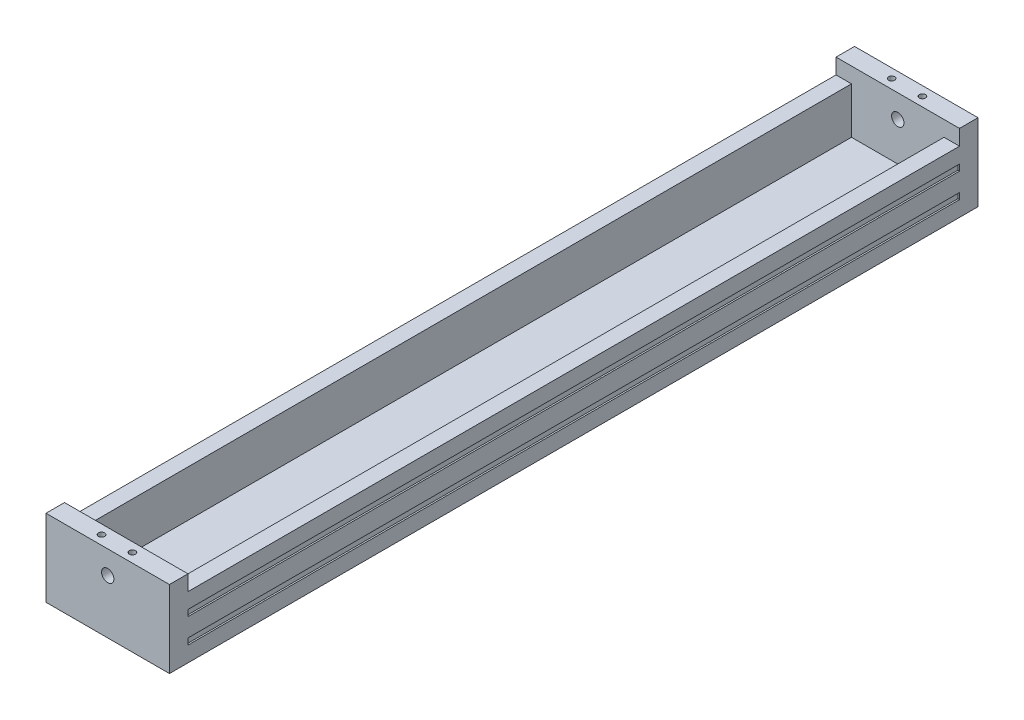
ISO-10303-21;
HEADER;
FILE_DESCRIPTION(('STEP AP214'),'2;1');
FILE_NAME('part.step','',(''),(''),'','','');
FILE_SCHEMA(('AUTOMOTIVE_DESIGN { 1 0 10303 214 1 1 1 1 }'));
ENDSEC;
DATA;
#1=APPLICATION_CONTEXT('core data for automotive mechanical design processes');
#2=APPLICATION_PROTOCOL_DEFINITION('international standard','automotive_design',2000,#1);
#3=PRODUCT_CONTEXT('',#1,'mechanical');
#4=PRODUCT('Part','Part','',(#3));
#5=PRODUCT_RELATED_PRODUCT_CATEGORY('part','',(#4));
#6=PRODUCT_DEFINITION_FORMATION('','',#4);
#7=PRODUCT_DEFINITION_CONTEXT('part definition',#1,'design');
#8=PRODUCT_DEFINITION('design','',#6,#7);
#9=PRODUCT_DEFINITION_SHAPE('','',#8);
#10=(LENGTH_UNIT() NAMED_UNIT(*) SI_UNIT(.MILLI.,.METRE.));
#11=(NAMED_UNIT(*) PLANE_ANGLE_UNIT() SI_UNIT($,.RADIAN.));
#12=(NAMED_UNIT(*) SI_UNIT($,.STERADIAN.) SOLID_ANGLE_UNIT());
#13=UNCERTAINTY_MEASURE_WITH_UNIT(LENGTH_MEASURE(1.E-05),#10,'distance_accuracy_value','');
#14=(GEOMETRIC_REPRESENTATION_CONTEXT(3) GLOBAL_UNCERTAINTY_ASSIGNED_CONTEXT((#13)) GLOBAL_UNIT_ASSIGNED_CONTEXT((#10,
#11,#12)) REPRESENTATION_CONTEXT('',''));
#15=CARTESIAN_POINT('',(0.,0.,0.));
#16=DIRECTION('',(0.,0.,1.));
#17=DIRECTION('',(1.,0.,0.));
#18=AXIS2_PLACEMENT_3D('',#15,#16,#17);
#19=CARTESIAN_POINT('',(-40.,25.,12.));
#20=DIRECTION('',(1.,0.,0.));
#21=DIRECTION('',(0.,1.,0.));
#22=AXIS2_PLACEMENT_3D('',#19,#20,#21);
#23=PLANE('',#22);
#24=DIRECTION('',(0.,0.,-1.));
#25=VECTOR('',#24,1.);
#26=CARTESIAN_POINT('',(-40.,-15.,0.));
#27=LINE('',#26,#25);
#28=CARTESIAN_POINT('',(-40.,-15.,0.));
#29=VERTEX_POINT('',#28);
#30=CARTESIAN_POINT('',(-40.,-15.,-500.));
#31=VERTEX_POINT('',#30);
#32=EDGE_CURVE('E352',#29,#31,#27,.T.);
#33=ORIENTED_EDGE('',*,*,#32,.T.);
#34=DIRECTION('',(0.,-1.,0.));
#35=VECTOR('',#34,1.);
#36=CARTESIAN_POINT('',(-40.,25.,-500.));
#37=LINE('',#36,#35);
#38=CARTESIAN_POINT('',(-40.,-11.,-500.));
#39=VERTEX_POINT('',#38);
#40=EDGE_CURVE('E252',#39,#31,#37,.T.);
#41=ORIENTED_EDGE('',*,*,#40,.F.);
#42=DIRECTION('',(0.,0.,-1.));
#43=VECTOR('',#42,1.);
#44=CARTESIAN_POINT('',(-40.,-11.,0.));
#45=LINE('',#44,#43);
#46=CARTESIAN_POINT('',(-40.,-11.,0.));
#47=VERTEX_POINT('',#46);
#48=EDGE_CURVE('E364',#47,#39,#45,.T.);
#49=ORIENTED_EDGE('',*,*,#48,.F.);
#50=DIRECTION('',(0.,1.,0.));
#51=VECTOR('',#50,1.);
#52=CARTESIAN_POINT('',(-40.,0.,0.));
#53=LINE('',#52,#51);
#54=EDGE_CURVE('E282',#29,#47,#53,.T.);
#55=ORIENTED_EDGE('',*,*,#54,.F.);
#56=EDGE_LOOP('',(#33,#41,#49,#55));
#57=FACE_BOUND('',#56,.T.);
#58=DIRECTION('',(0.,0.,-1.));
#59=VECTOR('',#58,1.);
#60=CARTESIAN_POINT('',(-40.,1.,0.));
#61=LINE('',#60,#59);
#62=CARTESIAN_POINT('',(-40.,1.,0.));
#63=VERTEX_POINT('',#62);
#64=CARTESIAN_POINT('',(-40.,0.999999999999938,-500.));
#65=VERTEX_POINT('',#64);
#66=EDGE_CURVE('E319',#63,#65,#61,.T.);
#67=ORIENTED_EDGE('',*,*,#66,.T.);
#68=CARTESIAN_POINT('',(-40.,4.99999999999997,-500.));
#69=VERTEX_POINT('',#68);
#70=EDGE_CURVE('E251',#69,#65,#37,.T.);
#71=ORIENTED_EDGE('',*,*,#70,.F.);
#72=DIRECTION('',(0.,0.,-1.));
#73=VECTOR('',#72,1.);
#74=CARTESIAN_POINT('',(-40.,5.,0.));
#75=LINE('',#74,#73);
#76=CARTESIAN_POINT('',(-40.,5.,0.));
#77=VERTEX_POINT('',#76);
#78=EDGE_CURVE('E332',#77,#69,#75,.T.);
#79=ORIENTED_EDGE('',*,*,#78,.F.);
#80=DIRECTION('',(0.,-1.,0.));
#81=VECTOR('',#80,1.);
#82=CARTESIAN_POINT('',(-40.,0.,0.));
#83=LINE('',#82,#81);
#84=EDGE_CURVE('E329',#77,#63,#83,.T.);
#85=ORIENTED_EDGE('',*,*,#84,.T.);
#86=EDGE_LOOP('',(#67,#71,#79,#85));
#87=FACE_BOUND('',#86,.T.);
#88=DIRECTION('',(0.,-1.,0.));
#89=VECTOR('',#88,1.);
#90=CARTESIAN_POINT('',(-40.,25.,-512.));
#91=LINE('',#90,#89);
#92=CARTESIAN_POINT('',(-40.,25.,-512.));
#93=VERTEX_POINT('',#92);
#94=CARTESIAN_POINT('',(-40.,-25.,-512.));
#95=VERTEX_POINT('',#94);
#96=EDGE_CURVE('E221',#93,#95,#91,.T.);
#97=ORIENTED_EDGE('',*,*,#96,.T.);
#98=DIRECTION('',(0.,0.,-1.));
#99=VECTOR('',#98,1.);
#100=CARTESIAN_POINT('',(-40.,-25.,12.));
#101=LINE('',#100,#99);
#102=CARTESIAN_POINT('',(-40.,-25.,12.));
#103=VERTEX_POINT('',#102);
#104=EDGE_CURVE('E11',#103,#95,#101,.T.);
#105=ORIENTED_EDGE('',*,*,#104,.F.);
#106=DIRECTION('',(0.,-1.,0.));
#107=VECTOR('',#106,1.);
#108=CARTESIAN_POINT('',(-40.,25.,12.));
#109=LINE('',#108,#107);
#110=CARTESIAN_POINT('',(-40.,25.,12.));
#111=VERTEX_POINT('',#110);
#112=EDGE_CURVE('E428',#111,#103,#109,.T.);
#113=ORIENTED_EDGE('',*,*,#112,.F.);
#114=DIRECTION('',(0.,0.,-1.));
#115=VECTOR('',#114,1.);
#116=CARTESIAN_POINT('',(-40.,25.,12.));
#117=LINE('',#116,#115);
#118=CARTESIAN_POINT('',(-40.,25.,0.));
#119=VERTEX_POINT('',#118);
#120=EDGE_CURVE('E438',#111,#119,#117,.T.);
#121=ORIENTED_EDGE('',*,*,#120,.T.);
#122=DIRECTION('',(0.,-1.,0.));
#123=VECTOR('',#122,1.);
#124=CARTESIAN_POINT('',(-40.,25.,0.));
#125=LINE('',#124,#123);
#126=CARTESIAN_POINT('',(-40.,15.,0.));
#127=VERTEX_POINT('',#126);
#128=EDGE_CURVE('E419',#119,#127,#125,.T.);
#129=ORIENTED_EDGE('',*,*,#128,.T.);
#130=DIRECTION('',(0.,0.,1.));
#131=VECTOR('',#130,1.);
#132=CARTESIAN_POINT('',(-40.,15.,-500.));
#133=LINE('',#132,#131);
#134=CARTESIAN_POINT('',(-40.,15.,-500.));
#135=VERTEX_POINT('',#134);
#136=EDGE_CURVE('E412',#135,#127,#133,.T.);
#137=ORIENTED_EDGE('',*,*,#136,.F.);
#138=CARTESIAN_POINT('',(-40.,25.,-500.));
#139=VERTEX_POINT('',#138);
#140=EDGE_CURVE('E224',#139,#135,#37,.T.);
#141=ORIENTED_EDGE('',*,*,#140,.F.);
#142=DIRECTION('',(0.,0.,1.));
#143=VECTOR('',#142,1.);
#144=CARTESIAN_POINT('',(-40.,25.,-512.));
#145=LINE('',#144,#143);
#146=EDGE_CURVE('E218',#93,#139,#145,.T.);
#147=ORIENTED_EDGE('',*,*,#146,.F.);
#148=EDGE_LOOP('',(#97,#105,#113,#121,#129,#137,#141,#147));
#149=FACE_BOUND('',#148,.T.);
#150=ADVANCED_FACE('F35',(#57,#87,#149),#23,.F.);
#151=CARTESIAN_POINT('',(40.,15.,-500.));
#152=DIRECTION('',(0.,-1.,0.));
#153=DIRECTION('',(0.,0.,-1.));
#154=AXIS2_PLACEMENT_3D('',#151,#152,#153);
#155=PLANE('',#154);
#156=DIRECTION('',(1.,0.,0.));
#157=VECTOR('',#156,1.);
#158=CARTESIAN_POINT('',(40.,15.,0.));
#159=LINE('',#158,#157);
#160=CARTESIAN_POINT('',(-29.9999999999999,15.,0.));
#161=VERTEX_POINT('',#160);
#162=EDGE_CURVE('E407',#127,#161,#159,.T.);
#163=ORIENTED_EDGE('',*,*,#162,.T.);
#164=DIRECTION('',(0.,0.,1.));
#165=VECTOR('',#164,1.);
#166=CARTESIAN_POINT('',(-30.,15.,-500.));
#167=LINE('',#166,#165);
#168=CARTESIAN_POINT('',(-30.,15.,-500.));
#169=VERTEX_POINT('',#168);
#170=EDGE_CURVE('E341',#169,#161,#167,.T.);
#171=ORIENTED_EDGE('',*,*,#170,.F.);
#172=DIRECTION('',(1.,0.,0.));
#173=VECTOR('',#172,1.);
#174=CARTESIAN_POINT('',(40.,15.,-500.));
#175=LINE('',#174,#173);
#176=EDGE_CURVE('E403',#135,#169,#175,.T.);
#177=ORIENTED_EDGE('',*,*,#176,.F.);
#178=ORIENTED_EDGE('',*,*,#136,.T.);
#179=EDGE_LOOP('',(#163,#171,#177,#178));
#180=FACE_BOUND('',#179,.T.);
#181=ADVANCED_FACE('F471',(#180),#155,.F.);
#182=CARTESIAN_POINT('',(0.,0.,0.));
#183=DIRECTION('',(0.,0.,1.));
#184=DIRECTION('',(1.,0.,0.));
#185=AXIS2_PLACEMENT_3D('',#182,#183,#184);
#186=PLANE('',#185);
#187=CARTESIAN_POINT('',(0.,10.,0.));
#188=DIRECTION('',(0.,0.,1.));
#189=DIRECTION('',(1.,0.,0.));
#190=AXIS2_PLACEMENT_3D('',#187,#188,#189);
#191=CIRCLE('',#190,4.);
#192=CARTESIAN_POINT('',(4.,10.,0.));
#193=VERTEX_POINT('',#192);
#194=EDGE_CURVE('E539',#193,#193,#191,.T.);
#195=ORIENTED_EDGE('',*,*,#194,.T.);
#196=EDGE_LOOP('',(#195));
#197=FACE_BOUND('',#196,.T.);
#198=ORIENTED_EDGE('',*,*,#162,.F.);
#199=ORIENTED_EDGE('',*,*,#128,.F.);
#200=DIRECTION('',(-1.,0.,0.));
#201=VECTOR('',#200,1.);
#202=CARTESIAN_POINT('',(-40.,25.,0.));
#203=LINE('',#202,#201);
#204=CARTESIAN_POINT('',(40.,25.,0.));
#205=VERTEX_POINT('',#204);
#206=EDGE_CURVE('E432',#205,#119,#203,.T.);
#207=ORIENTED_EDGE('',*,*,#206,.F.);
#208=DIRECTION('',(0.,1.,0.));
#209=VECTOR('',#208,1.);
#210=CARTESIAN_POINT('',(40.,25.,0.));
#211=LINE('',#210,#209);
#212=CARTESIAN_POINT('',(40.,15.,0.));
#213=VERTEX_POINT('',#212);
#214=EDGE_CURVE('E441',#213,#205,#211,.T.);
#215=ORIENTED_EDGE('',*,*,#214,.F.);
#216=CARTESIAN_POINT('',(30.0000000000001,15.,0.));
#217=VERTEX_POINT('',#216);
#218=EDGE_CURVE('E397',#217,#213,#159,.T.);
#219=ORIENTED_EDGE('',*,*,#218,.F.);
#220=DIRECTION('',(0.,1.,0.));
#221=VECTOR('',#220,1.);
#222=CARTESIAN_POINT('',(30.0000000000001,-14.9999999999999,0.));
#223=LINE('',#222,#221);
#224=CARTESIAN_POINT('',(30.0000000000001,-14.9999999999999,0.));
#225=VERTEX_POINT('',#224);
#226=EDGE_CURVE('E400',#225,#217,#223,.T.);
#227=ORIENTED_EDGE('',*,*,#226,.F.);
#228=DIRECTION('',(1.,0.,0.));
#229=VECTOR('',#228,1.);
#230=CARTESIAN_POINT('',(-29.9999999999999,-14.9999999999999,0.));
#231=LINE('',#230,#229);
#232=CARTESIAN_POINT('',(-29.9999999999999,-14.9999999999999,0.));
#233=VERTEX_POINT('',#232);
#234=EDGE_CURVE('E379',#233,#225,#231,.T.);
#235=ORIENTED_EDGE('',*,*,#234,.F.);
#236=DIRECTION('',(0.,1.,0.));
#237=VECTOR('',#236,1.);
#238=CARTESIAN_POINT('',(-29.9999999999999,-14.9999999999999,0.));
#239=LINE('',#238,#237);
#240=EDGE_CURVE('E389',#233,#161,#239,.T.);
#241=ORIENTED_EDGE('',*,*,#240,.T.);
#242=EDGE_LOOP('',(#198,#199,#207,#215,#219,#227,#235,#241));
#243=FACE_BOUND('',#242,.T.);
#244=ADVANCED_FACE('F467',(#197,#243),#186,.F.);
#245=CARTESIAN_POINT('',(-40.,-25.,12.));
#246=DIRECTION('',(0.,1.,0.));
#247=DIRECTION('',(0.,0.,1.));
#248=AXIS2_PLACEMENT_3D('',#245,#246,#247);
#249=PLANE('',#248);
#250=ORIENTED_EDGE('',*,*,#104,.T.);
#251=DIRECTION('',(1.,0.,0.));
#252=VECTOR('',#251,1.);
#253=CARTESIAN_POINT('',(-40.,-25.,-512.));
#254=LINE('',#253,#252);
#255=CARTESIAN_POINT('',(40.,-25.,-512.));
#256=VERTEX_POINT('',#255);
#257=EDGE_CURVE('E238',#95,#256,#254,.T.);
#258=ORIENTED_EDGE('',*,*,#257,.T.);
#259=DIRECTION('',(0.,0.,-1.));
#260=VECTOR('',#259,1.);
#261=CARTESIAN_POINT('',(40.,-25.,12.));
#262=LINE('',#261,#260);
#263=CARTESIAN_POINT('',(40.,-25.,12.));
#264=VERTEX_POINT('',#263);
#265=EDGE_CURVE('E42',#264,#256,#262,.T.);
#266=ORIENTED_EDGE('',*,*,#265,.F.);
#267=DIRECTION('',(1.,0.,0.));
#268=VECTOR('',#267,1.);
#269=CARTESIAN_POINT('',(-40.,-25.,12.));
#270=LINE('',#269,#268);
#271=EDGE_CURVE('E431',#103,#264,#270,.T.);
#272=ORIENTED_EDGE('',*,*,#271,.F.);
#273=EDGE_LOOP('',(#250,#258,#266,#272));
#274=FACE_BOUND('',#273,.T.);
#275=ADVANCED_FACE('F455',(#274),#249,.F.);
#276=CARTESIAN_POINT('',(40.,25.,12.));
#277=DIRECTION('',(-1.,0.,0.));
#278=DIRECTION('',(0.,-1.,0.));
#279=AXIS2_PLACEMENT_3D('',#276,#277,#278);
#280=PLANE('',#279);
#281=DIRECTION('',(0.,0.,1.));
#282=VECTOR('',#281,1.);
#283=CARTESIAN_POINT('',(40.,-11.,0.));
#284=LINE('',#283,#282);
#285=CARTESIAN_POINT('',(40.,-11.,-500.));
#286=VERTEX_POINT('',#285);
#287=CARTESIAN_POINT('',(40.,-11.,0.));
#288=VERTEX_POINT('',#287);
#289=EDGE_CURVE('E292',#286,#288,#284,.T.);
#290=ORIENTED_EDGE('',*,*,#289,.F.);
#291=DIRECTION('',(0.,1.,0.));
#292=VECTOR('',#291,1.);
#293=CARTESIAN_POINT('',(40.,25.,-500.));
#294=LINE('',#293,#292);
#295=CARTESIAN_POINT('',(40.,-15.,-500.));
#296=VERTEX_POINT('',#295);
#297=EDGE_CURVE('E239',#296,#286,#294,.T.);
#298=ORIENTED_EDGE('',*,*,#297,.F.);
#299=DIRECTION('',(0.,0.,-1.));
#300=VECTOR('',#299,1.);
#301=CARTESIAN_POINT('',(40.,-15.,0.));
#302=LINE('',#301,#300);
#303=CARTESIAN_POINT('',(40.,-15.,0.));
#304=VERTEX_POINT('',#303);
#305=EDGE_CURVE('E303',#304,#296,#302,.T.);
#306=ORIENTED_EDGE('',*,*,#305,.F.);
#307=DIRECTION('',(0.,-1.,0.));
#308=VECTOR('',#307,1.);
#309=CARTESIAN_POINT('',(40.,-11.,0.));
#310=LINE('',#309,#308);
#311=EDGE_CURVE('E49',#288,#304,#310,.T.);
#312=ORIENTED_EDGE('',*,*,#311,.F.);
#313=EDGE_LOOP('',(#290,#298,#306,#312));
#314=FACE_BOUND('',#313,.T.);
#315=ORIENTED_EDGE('',*,*,#265,.T.);
#316=DIRECTION('',(0.,1.,0.));
#317=VECTOR('',#316,1.);
#318=CARTESIAN_POINT('',(40.,25.,-512.));
#319=LINE('',#318,#317);
#320=CARTESIAN_POINT('',(40.,25.,-512.));
#321=VERTEX_POINT('',#320);
#322=EDGE_CURVE('E243',#256,#321,#319,.T.);
#323=ORIENTED_EDGE('',*,*,#322,.T.);
#324=DIRECTION('',(0.,0.,1.));
#325=VECTOR('',#324,1.);
#326=CARTESIAN_POINT('',(40.,25.,-512.));
#327=LINE('',#326,#325);
#328=CARTESIAN_POINT('',(40.,25.,-500.));
#329=VERTEX_POINT('',#328);
#330=EDGE_CURVE('E229',#321,#329,#327,.T.);
#331=ORIENTED_EDGE('',*,*,#330,.T.);
#332=CARTESIAN_POINT('',(40.,15.,-500.));
#333=VERTEX_POINT('',#332);
#334=EDGE_CURVE('E254',#333,#329,#294,.T.);
#335=ORIENTED_EDGE('',*,*,#334,.F.);
#336=DIRECTION('',(0.,0.,1.));
#337=VECTOR('',#336,1.);
#338=CARTESIAN_POINT('',(40.,15.,-500.));
#339=LINE('',#338,#337);
#340=EDGE_CURVE('E405',#333,#213,#339,.T.);
#341=ORIENTED_EDGE('',*,*,#340,.T.);
#342=ORIENTED_EDGE('',*,*,#214,.T.);
#343=DIRECTION('',(0.,0.,-1.));
#344=VECTOR('',#343,1.);
#345=CARTESIAN_POINT('',(40.,25.,12.));
#346=LINE('',#345,#344);
#347=CARTESIAN_POINT('',(40.,25.,12.));
#348=VERTEX_POINT('',#347);
#349=EDGE_CURVE('E446',#348,#205,#346,.T.);
#350=ORIENTED_EDGE('',*,*,#349,.F.);
#351=DIRECTION('',(0.,1.,0.));
#352=VECTOR('',#351,1.);
#353=CARTESIAN_POINT('',(40.,25.,12.));
#354=LINE('',#353,#352);
#355=EDGE_CURVE('E434',#264,#348,#354,.T.);
#356=ORIENTED_EDGE('',*,*,#355,.F.);
#357=EDGE_LOOP('',(#315,#323,#331,#335,#341,#342,#350,#356));
#358=FACE_BOUND('',#357,.T.);
#359=CARTESIAN_POINT('',(40.,0.999999999999997,-500.));
#360=VERTEX_POINT('',#359);
#361=CARTESIAN_POINT('',(40.,4.99999999999997,-500.));
#362=VERTEX_POINT('',#361);
#363=EDGE_CURVE('E57',#360,#362,#294,.T.);
#364=ORIENTED_EDGE('',*,*,#363,.F.);
#365=DIRECTION('',(0.,0.,-1.));
#366=VECTOR('',#365,1.);
#367=CARTESIAN_POINT('',(40.,0.999999999999999,-500.));
#368=LINE('',#367,#366);
#369=CARTESIAN_POINT('',(40.,0.999999999999938,0.));
#370=VERTEX_POINT('',#369);
#371=EDGE_CURVE('E261',#370,#360,#368,.T.);
#372=ORIENTED_EDGE('',*,*,#371,.F.);
#373=DIRECTION('',(0.,-1.,0.));
#374=VECTOR('',#373,1.);
#375=CARTESIAN_POINT('',(40.,4.99999999999994,0.));
#376=LINE('',#375,#374);
#377=CARTESIAN_POINT('',(40.,4.99999999999994,0.));
#378=VERTEX_POINT('',#377);
#379=EDGE_CURVE('E274',#378,#370,#376,.T.);
#380=ORIENTED_EDGE('',*,*,#379,.F.);
#381=DIRECTION('',(0.,0.,1.));
#382=VECTOR('',#381,1.);
#383=CARTESIAN_POINT('',(40.,5.,-500.));
#384=LINE('',#383,#382);
#385=EDGE_CURVE('E271',#362,#378,#384,.T.);
#386=ORIENTED_EDGE('',*,*,#385,.F.);
#387=EDGE_LOOP('',(#364,#372,#380,#386));
#388=FACE_BOUND('',#387,.T.);
#389=ADVANCED_FACE('F451',(#314,#358,#388),#280,.F.);
#390=CARTESIAN_POINT('',(-40.,25.,12.));
#391=DIRECTION('',(0.,-1.,0.));
#392=DIRECTION('',(0.,0.,-1.));
#393=AXIS2_PLACEMENT_3D('',#390,#391,#392);
#394=PLANE('',#393);
#395=CARTESIAN_POINT('',(-10.,25.,6.));
#396=DIRECTION('',(0.,1.,0.));
#397=DIRECTION('',(0.,0.,1.));
#398=AXIS2_PLACEMENT_3D('',#395,#396,#397);
#399=CIRCLE('',#398,2.);
#400=CARTESIAN_POINT('',(-10.,25.,8.));
#401=VERTEX_POINT('',#400);
#402=EDGE_CURVE('E420',#401,#401,#399,.T.);
#403=ORIENTED_EDGE('',*,*,#402,.F.);
#404=EDGE_LOOP('',(#403));
#405=FACE_BOUND('',#404,.T.);
#406=CARTESIAN_POINT('',(9.99999999999999,25.,6.));
#407=DIRECTION('',(0.,1.,0.));
#408=DIRECTION('',(0.,0.,1.));
#409=AXIS2_PLACEMENT_3D('',#406,#407,#408);
#410=CIRCLE('',#409,2.);
#411=CARTESIAN_POINT('',(9.99999999999999,25.,8.));
#412=VERTEX_POINT('',#411);
#413=EDGE_CURVE('E415',#412,#412,#410,.T.);
#414=ORIENTED_EDGE('',*,*,#413,.F.);
#415=EDGE_LOOP('',(#414));
#416=FACE_BOUND('',#415,.T.);
#417=ORIENTED_EDGE('',*,*,#206,.T.);
#418=ORIENTED_EDGE('',*,*,#120,.F.);
#419=DIRECTION('',(-1.,0.,0.));
#420=VECTOR('',#419,1.);
#421=CARTESIAN_POINT('',(-40.,25.,12.));
#422=LINE('',#421,#420);
#423=EDGE_CURVE('E436',#348,#111,#422,.T.);
#424=ORIENTED_EDGE('',*,*,#423,.F.);
#425=ORIENTED_EDGE('',*,*,#349,.T.);
#426=EDGE_LOOP('',(#417,#418,#424,#425));
#427=FACE_BOUND('',#426,.T.);
#428=ADVANCED_FACE('F463',(#405,#416,#427),#394,.F.);
#429=CARTESIAN_POINT('',(0.,0.,12.));
#430=DIRECTION('',(0.,0.,1.));
#431=DIRECTION('',(1.,0.,0.));
#432=AXIS2_PLACEMENT_3D('',#429,#430,#431);
#433=PLANE('',#432);
#434=CARTESIAN_POINT('',(0.,10.,12.));
#435=DIRECTION('',(0.,0.,1.));
#436=DIRECTION('',(1.,0.,0.));
#437=AXIS2_PLACEMENT_3D('',#434,#435,#436);
#438=CIRCLE('',#437,4.);
#439=CARTESIAN_POINT('',(4.,10.,12.));
#440=VERTEX_POINT('',#439);
#441=EDGE_CURVE('E548',#440,#440,#438,.T.);
#442=ORIENTED_EDGE('',*,*,#441,.F.);
#443=EDGE_LOOP('',(#442));
#444=FACE_BOUND('',#443,.T.);
#445=ORIENTED_EDGE('',*,*,#112,.T.);
#446=ORIENTED_EDGE('',*,*,#271,.T.);
#447=ORIENTED_EDGE('',*,*,#355,.T.);
#448=ORIENTED_EDGE('',*,*,#423,.T.);
#449=EDGE_LOOP('',(#445,#446,#447,#448));
#450=FACE_BOUND('',#449,.T.);
#451=ADVANCED_FACE('F460',(#444,#450),#433,.T.);
#452=CARTESIAN_POINT('',(9.99999999999999,22.,6.));
#453=DIRECTION('',(0.,1.,0.));
#454=DIRECTION('',(0.,0.,1.));
#455=AXIS2_PLACEMENT_3D('',#452,#453,#454);
#456=CYLINDRICAL_SURFACE('',#455,2.);
#457=CARTESIAN_POINT('',(9.99999999999999,22.,6.));
#458=DIRECTION('',(0.,1.,0.));
#459=DIRECTION('',(0.,0.,1.));
#460=AXIS2_PLACEMENT_3D('',#457,#458,#459);
#461=CIRCLE('',#460,2.);
#462=CARTESIAN_POINT('',(9.99999999999999,22.,8.));
#463=VERTEX_POINT('',#462);
#464=EDGE_CURVE('E423',#463,#463,#461,.T.);
#465=ORIENTED_EDGE('',*,*,#464,.F.);
#466=EDGE_LOOP('',(#465));
#467=FACE_BOUND('',#466,.T.);
#468=ORIENTED_EDGE('',*,*,#413,.T.);
#469=EDGE_LOOP('',(#468));
#470=FACE_BOUND('',#469,.T.);
#471=ADVANCED_FACE('F803',(#467,#470),#456,.F.);
#472=CARTESIAN_POINT('',(9.99999999999999,22.,6.));
#473=DIRECTION('',(0.,1.,0.));
#474=DIRECTION('',(0.,0.,1.));
#475=AXIS2_PLACEMENT_3D('',#472,#473,#474);
#476=PLANE('',#475);
#477=ORIENTED_EDGE('',*,*,#464,.T.);
#478=EDGE_LOOP('',(#477));
#479=FACE_BOUND('',#478,.T.);
#480=ADVANCED_FACE('F819',(#479),#476,.T.);
#481=CARTESIAN_POINT('',(-10.,22.,6.));
#482=DIRECTION('',(0.,1.,0.));
#483=DIRECTION('',(0.,0.,1.));
#484=AXIS2_PLACEMENT_3D('',#481,#482,#483);
#485=CYLINDRICAL_SURFACE('',#484,2.);
#486=CARTESIAN_POINT('',(-10.,22.,6.));
#487=DIRECTION('',(0.,1.,0.));
#488=DIRECTION('',(0.,0.,1.));
#489=AXIS2_PLACEMENT_3D('',#486,#487,#488);
#490=CIRCLE('',#489,2.);
#491=CARTESIAN_POINT('',(-10.,22.,8.));
#492=VERTEX_POINT('',#491);
#493=EDGE_CURVE('E416',#492,#492,#490,.T.);
#494=ORIENTED_EDGE('',*,*,#493,.F.);
#495=EDGE_LOOP('',(#494));
#496=FACE_BOUND('',#495,.T.);
#497=ORIENTED_EDGE('',*,*,#402,.T.);
#498=EDGE_LOOP('',(#497));
#499=FACE_BOUND('',#498,.T.);
#500=ADVANCED_FACE('F499',(#496,#499),#485,.F.);
#501=CARTESIAN_POINT('',(-10.,22.,6.));
#502=DIRECTION('',(0.,1.,0.));
#503=DIRECTION('',(0.,0.,1.));
#504=AXIS2_PLACEMENT_3D('',#501,#502,#503);
#505=PLANE('',#504);
#506=ORIENTED_EDGE('',*,*,#493,.T.);
#507=EDGE_LOOP('',(#506));
#508=FACE_BOUND('',#507,.T.);
#509=ADVANCED_FACE('F492',(#508),#505,.T.);
#510=CARTESIAN_POINT('',(30.,15.,-500.));
#511=VERTEX_POINT('',#510);
#512=EDGE_CURVE('E406',#511,#333,#175,.T.);
#513=ORIENTED_EDGE('',*,*,#512,.F.);
#514=DIRECTION('',(0.,0.,-1.));
#515=VECTOR('',#514,1.);
#516=CARTESIAN_POINT('',(30.,15.,-500.));
#517=LINE('',#516,#515);
#518=EDGE_CURVE('E380',#217,#511,#517,.T.);
#519=ORIENTED_EDGE('',*,*,#518,.F.);
#520=ORIENTED_EDGE('',*,*,#218,.T.);
#521=ORIENTED_EDGE('',*,*,#340,.F.);
#522=EDGE_LOOP('',(#513,#519,#520,#521));
#523=FACE_BOUND('',#522,.T.);
#524=ADVANCED_FACE('F490',(#523),#155,.F.);
#525=CARTESIAN_POINT('',(-30.,-14.9999999999999,-500.));
#526=DIRECTION('',(-1.,0.,0.));
#527=DIRECTION('',(0.,0.,1.));
#528=AXIS2_PLACEMENT_3D('',#525,#526,#527);
#529=PLANE('',#528);
#530=ORIENTED_EDGE('',*,*,#170,.T.);
#531=ORIENTED_EDGE('',*,*,#240,.F.);
#532=DIRECTION('',(0.,0.,1.));
#533=VECTOR('',#532,1.);
#534=CARTESIAN_POINT('',(-30.,-14.9999999999999,-500.));
#535=LINE('',#534,#533);
#536=CARTESIAN_POINT('',(-30.,-14.9999999999999,-500.));
#537=VERTEX_POINT('',#536);
#538=EDGE_CURVE('E376',#537,#233,#535,.T.);
#539=ORIENTED_EDGE('',*,*,#538,.F.);
#540=DIRECTION('',(0.,1.,0.));
#541=VECTOR('',#540,1.);
#542=CARTESIAN_POINT('',(-30.,-14.9999999999999,-500.));
#543=LINE('',#542,#541);
#544=EDGE_CURVE('E394',#537,#169,#543,.T.);
#545=ORIENTED_EDGE('',*,*,#544,.T.);
#546=EDGE_LOOP('',(#530,#531,#539,#545));
#547=FACE_BOUND('',#546,.T.);
#548=ADVANCED_FACE('F477',(#547),#529,.F.);
#549=CARTESIAN_POINT('',(30.,-14.9999999999999,-500.));
#550=DIRECTION('',(1.,0.,0.));
#551=DIRECTION('',(0.,0.,-1.));
#552=AXIS2_PLACEMENT_3D('',#549,#550,#551);
#553=PLANE('',#552);
#554=ORIENTED_EDGE('',*,*,#518,.T.);
#555=DIRECTION('',(0.,1.,0.));
#556=VECTOR('',#555,1.);
#557=CARTESIAN_POINT('',(30.,-14.9999999999999,-500.));
#558=LINE('',#557,#556);
#559=CARTESIAN_POINT('',(30.0000000000001,-14.9999999999999,-500.));
#560=VERTEX_POINT('',#559);
#561=EDGE_CURVE('E398',#560,#511,#558,.T.);
#562=ORIENTED_EDGE('',*,*,#561,.F.);
#563=DIRECTION('',(0.,0.,-1.));
#564=VECTOR('',#563,1.);
#565=CARTESIAN_POINT('',(30.,-14.9999999999999,-500.));
#566=LINE('',#565,#564);
#567=EDGE_CURVE('E383',#225,#560,#566,.T.);
#568=ORIENTED_EDGE('',*,*,#567,.F.);
#569=ORIENTED_EDGE('',*,*,#226,.T.);
#570=EDGE_LOOP('',(#554,#562,#568,#569));
#571=FACE_BOUND('',#570,.T.);
#572=ADVANCED_FACE('F487',(#571),#553,.F.);
#573=CARTESIAN_POINT('',(0.,-14.9999999999999,0.));
#574=DIRECTION('',(0.,1.,0.));
#575=DIRECTION('',(0.,0.,1.));
#576=AXIS2_PLACEMENT_3D('',#573,#574,#575);
#577=PLANE('',#576);
#578=ORIENTED_EDGE('',*,*,#538,.T.);
#579=ORIENTED_EDGE('',*,*,#234,.T.);
#580=ORIENTED_EDGE('',*,*,#567,.T.);
#581=DIRECTION('',(-1.,0.,0.));
#582=VECTOR('',#581,1.);
#583=CARTESIAN_POINT('',(-30.,-14.9999999999999,-500.));
#584=LINE('',#583,#582);
#585=EDGE_CURVE('E386',#560,#537,#584,.T.);
#586=ORIENTED_EDGE('',*,*,#585,.T.);
#587=EDGE_LOOP('',(#578,#579,#580,#586));
#588=FACE_BOUND('',#587,.T.);
#589=ADVANCED_FACE('F480',(#588),#577,.T.);
#590=CARTESIAN_POINT('',(-39.,0.,0.));
#591=DIRECTION('',(0.,0.,1.));
#592=DIRECTION('',(0.,-1.,0.));
#593=AXIS2_PLACEMENT_3D('',#590,#591,#592);
#594=PLANE('',#593);
#595=ORIENTED_EDGE('',*,*,#54,.T.);
#596=DIRECTION('',(-1.,0.,0.));
#597=VECTOR('',#596,1.);
#598=CARTESIAN_POINT('',(-39.,-11.,0.));
#599=LINE('',#598,#597);
#600=CARTESIAN_POINT('',(-39.,-11.,0.));
#601=VERTEX_POINT('',#600);
#602=EDGE_CURVE('E361',#601,#47,#599,.T.);
#603=ORIENTED_EDGE('',*,*,#602,.F.);
#604=DIRECTION('',(0.,1.,0.));
#605=VECTOR('',#604,1.);
#606=CARTESIAN_POINT('',(-39.,0.,0.));
#607=LINE('',#606,#605);
#608=CARTESIAN_POINT('',(-39.,-15.,0.));
#609=VERTEX_POINT('',#608);
#610=EDGE_CURVE('E348',#609,#601,#607,.T.);
#611=ORIENTED_EDGE('',*,*,#610,.F.);
#612=DIRECTION('',(-1.,0.,0.));
#613=VECTOR('',#612,1.);
#614=CARTESIAN_POINT('',(-39.,-15.,0.));
#615=LINE('',#614,#613);
#616=EDGE_CURVE('E333',#609,#29,#615,.T.);
#617=ORIENTED_EDGE('',*,*,#616,.T.);
#618=EDGE_LOOP('',(#595,#603,#611,#617));
#619=FACE_BOUND('',#618,.T.);
#620=ADVANCED_FACE('F627',(#619),#594,.F.);
#621=CARTESIAN_POINT('',(-39.,-15.,0.));
#622=DIRECTION('',(0.,1.,0.));
#623=DIRECTION('',(-1.,0.,0.));
#624=AXIS2_PLACEMENT_3D('',#621,#622,#623);
#625=PLANE('',#624);
#626=ORIENTED_EDGE('',*,*,#32,.F.);
#627=ORIENTED_EDGE('',*,*,#616,.F.);
#628=DIRECTION('',(0.,0.,-1.));
#629=VECTOR('',#628,1.);
#630=CARTESIAN_POINT('',(-39.,-15.,0.));
#631=LINE('',#630,#629);
#632=CARTESIAN_POINT('',(-39.,-15.,-500.));
#633=VERTEX_POINT('',#632);
#634=EDGE_CURVE('E358',#609,#633,#631,.T.);
#635=ORIENTED_EDGE('',*,*,#634,.T.);
#636=DIRECTION('',(-1.,0.,0.));
#637=VECTOR('',#636,1.);
#638=CARTESIAN_POINT('',(-39.,-15.,-500.));
#639=LINE('',#638,#637);
#640=EDGE_CURVE('E370',#633,#31,#639,.T.);
#641=ORIENTED_EDGE('',*,*,#640,.T.);
#642=EDGE_LOOP('',(#626,#627,#635,#641));
#643=FACE_BOUND('',#642,.T.);
#644=ADVANCED_FACE('F624',(#643),#625,.T.);
#645=CARTESIAN_POINT('',(-39.,-11.,0.));
#646=DIRECTION('',(0.,1.,0.));
#647=DIRECTION('',(-1.,0.,0.));
#648=AXIS2_PLACEMENT_3D('',#645,#646,#647);
#649=PLANE('',#648);
#650=ORIENTED_EDGE('',*,*,#48,.T.);
#651=DIRECTION('',(-1.,0.,0.));
#652=VECTOR('',#651,1.);
#653=CARTESIAN_POINT('',(-39.,-11.,-500.));
#654=LINE('',#653,#652);
#655=CARTESIAN_POINT('',(-39.,-11.,-500.));
#656=VERTEX_POINT('',#655);
#657=EDGE_CURVE('E373',#656,#39,#654,.T.);
#658=ORIENTED_EDGE('',*,*,#657,.F.);
#659=DIRECTION('',(0.,0.,-1.));
#660=VECTOR('',#659,1.);
#661=CARTESIAN_POINT('',(-39.,-11.,0.));
#662=LINE('',#661,#660);
#663=EDGE_CURVE('E351',#601,#656,#662,.T.);
#664=ORIENTED_EDGE('',*,*,#663,.F.);
#665=ORIENTED_EDGE('',*,*,#602,.T.);
#666=EDGE_LOOP('',(#650,#658,#664,#665));
#667=FACE_BOUND('',#666,.T.);
#668=ADVANCED_FACE('F622',(#667),#649,.F.);
#669=CARTESIAN_POINT('',(-39.,0.,0.));
#670=DIRECTION('',(-1.,0.,0.));
#671=DIRECTION('',(0.,-1.,0.));
#672=AXIS2_PLACEMENT_3D('',#669,#670,#671);
#673=PLANE('',#672);
#674=ORIENTED_EDGE('',*,*,#610,.T.);
#675=ORIENTED_EDGE('',*,*,#663,.T.);
#676=DIRECTION('',(0.,-1.,0.));
#677=VECTOR('',#676,1.);
#678=CARTESIAN_POINT('',(-39.,0.,-500.));
#679=LINE('',#678,#677);
#680=EDGE_CURVE('E355',#656,#633,#679,.T.);
#681=ORIENTED_EDGE('',*,*,#680,.T.);
#682=ORIENTED_EDGE('',*,*,#634,.F.);
#683=EDGE_LOOP('',(#674,#675,#681,#682));
#684=FACE_BOUND('',#683,.T.);
#685=ADVANCED_FACE('F619',(#684),#673,.T.);
#686=CARTESIAN_POINT('',(-39.,0.,0.));
#687=DIRECTION('',(0.,0.,-1.));
#688=DIRECTION('',(0.,1.,0.));
#689=AXIS2_PLACEMENT_3D('',#686,#687,#688);
#690=PLANE('',#689);
#691=ORIENTED_EDGE('',*,*,#84,.F.);
#692=DIRECTION('',(-1.,0.,0.));
#693=VECTOR('',#692,1.);
#694=CARTESIAN_POINT('',(-39.,5.,0.));
#695=LINE('',#694,#693);
#696=CARTESIAN_POINT('',(-39.,5.,0.));
#697=VERTEX_POINT('',#696);
#698=EDGE_CURVE('E328',#697,#77,#695,.T.);
#699=ORIENTED_EDGE('',*,*,#698,.F.);
#700=DIRECTION('',(0.,-1.,0.));
#701=VECTOR('',#700,1.);
#702=CARTESIAN_POINT('',(-39.,0.,0.));
#703=LINE('',#702,#701);
#704=CARTESIAN_POINT('',(-39.,1.,0.));
#705=VERTEX_POINT('',#704);
#706=EDGE_CURVE('E315',#697,#705,#703,.T.);
#707=ORIENTED_EDGE('',*,*,#706,.T.);
#708=DIRECTION('',(-1.,0.,0.));
#709=VECTOR('',#708,1.);
#710=CARTESIAN_POINT('',(-39.,1.,0.));
#711=LINE('',#710,#709);
#712=EDGE_CURVE('E338',#705,#63,#711,.T.);
#713=ORIENTED_EDGE('',*,*,#712,.T.);
#714=EDGE_LOOP('',(#691,#699,#707,#713));
#715=FACE_BOUND('',#714,.T.);
#716=ADVANCED_FACE('F518',(#715),#690,.T.);
#717=CARTESIAN_POINT('',(-39.,1.,0.));
#718=DIRECTION('',(0.,1.,0.));
#719=DIRECTION('',(-1.,0.,0.));
#720=AXIS2_PLACEMENT_3D('',#717,#718,#719);
#721=PLANE('',#720);
#722=ORIENTED_EDGE('',*,*,#66,.F.);
#723=ORIENTED_EDGE('',*,*,#712,.F.);
#724=DIRECTION('',(0.,0.,-1.));
#725=VECTOR('',#724,1.);
#726=CARTESIAN_POINT('',(-39.,1.,0.));
#727=LINE('',#726,#725);
#728=CARTESIAN_POINT('',(-39.,0.999999999999938,-500.));
#729=VERTEX_POINT('',#728);
#730=EDGE_CURVE('E325',#705,#729,#727,.T.);
#731=ORIENTED_EDGE('',*,*,#730,.T.);
#732=DIRECTION('',(-1.,0.,0.));
#733=VECTOR('',#732,1.);
#734=CARTESIAN_POINT('',(-39.,0.999999999999938,-500.));
#735=LINE('',#734,#733);
#736=EDGE_CURVE('E342',#729,#65,#735,.T.);
#737=ORIENTED_EDGE('',*,*,#736,.T.);
#738=EDGE_LOOP('',(#722,#723,#731,#737));
#739=FACE_BOUND('',#738,.T.);
#740=ADVANCED_FACE('F516',(#739),#721,.T.);
#741=CARTESIAN_POINT('',(-39.,5.,0.));
#742=DIRECTION('',(0.,1.,0.));
#743=DIRECTION('',(-1.,0.,0.));
#744=AXIS2_PLACEMENT_3D('',#741,#742,#743);
#745=PLANE('',#744);
#746=ORIENTED_EDGE('',*,*,#78,.T.);
#747=DIRECTION('',(-1.,0.,0.));
#748=VECTOR('',#747,1.);
#749=CARTESIAN_POINT('',(-39.,4.99999999999994,-500.));
#750=LINE('',#749,#748);
#751=CARTESIAN_POINT('',(-39.,5.,-500.));
#752=VERTEX_POINT('',#751);
#753=EDGE_CURVE('E345',#752,#69,#750,.T.);
#754=ORIENTED_EDGE('',*,*,#753,.F.);
#755=DIRECTION('',(0.,0.,-1.));
#756=VECTOR('',#755,1.);
#757=CARTESIAN_POINT('',(-39.,5.,0.));
#758=LINE('',#757,#756);
#759=EDGE_CURVE('E318',#697,#752,#758,.T.);
#760=ORIENTED_EDGE('',*,*,#759,.F.);
#761=ORIENTED_EDGE('',*,*,#698,.T.);
#762=EDGE_LOOP('',(#746,#754,#760,#761));
#763=FACE_BOUND('',#762,.T.);
#764=ADVANCED_FACE('F525',(#763),#745,.F.);
#765=CARTESIAN_POINT('',(-39.,0.,0.));
#766=DIRECTION('',(-1.,0.,0.));
#767=DIRECTION('',(0.,-1.,0.));
#768=AXIS2_PLACEMENT_3D('',#765,#766,#767);
#769=PLANE('',#768);
#770=ORIENTED_EDGE('',*,*,#706,.F.);
#771=ORIENTED_EDGE('',*,*,#759,.T.);
#772=DIRECTION('',(0.,-1.,0.));
#773=VECTOR('',#772,1.);
#774=CARTESIAN_POINT('',(-39.,0.,-500.));
#775=LINE('',#774,#773);
#776=EDGE_CURVE('E322',#752,#729,#775,.T.);
#777=ORIENTED_EDGE('',*,*,#776,.T.);
#778=ORIENTED_EDGE('',*,*,#730,.F.);
#779=EDGE_LOOP('',(#770,#771,#777,#778));
#780=FACE_BOUND('',#779,.T.);
#781=ADVANCED_FACE('F522',(#780),#769,.T.);
#782=CARTESIAN_POINT('',(39.,-11.,0.));
#783=DIRECTION('',(0.,0.,1.));
#784=DIRECTION('',(0.,-1.,0.));
#785=AXIS2_PLACEMENT_3D('',#782,#783,#784);
#786=PLANE('',#785);
#787=ORIENTED_EDGE('',*,*,#311,.T.);
#788=DIRECTION('',(1.,0.,0.));
#789=VECTOR('',#788,1.);
#790=CARTESIAN_POINT('',(39.,-15.,0.));
#791=LINE('',#790,#789);
#792=CARTESIAN_POINT('',(39.,-15.,0.));
#793=VERTEX_POINT('',#792);
#794=EDGE_CURVE('E301',#793,#304,#791,.T.);
#795=ORIENTED_EDGE('',*,*,#794,.F.);
#796=DIRECTION('',(0.,-1.,0.));
#797=VECTOR('',#796,1.);
#798=CARTESIAN_POINT('',(39.,-11.,0.));
#799=LINE('',#798,#797);
#800=CARTESIAN_POINT('',(39.,-11.,0.));
#801=VERTEX_POINT('',#800);
#802=EDGE_CURVE('E288',#801,#793,#799,.T.);
#803=ORIENTED_EDGE('',*,*,#802,.F.);
#804=DIRECTION('',(1.,0.,0.));
#805=VECTOR('',#804,1.);
#806=CARTESIAN_POINT('',(39.,-11.,0.));
#807=LINE('',#806,#805);
#808=EDGE_CURVE('E275',#801,#288,#807,.T.);
#809=ORIENTED_EDGE('',*,*,#808,.T.);
#810=EDGE_LOOP('',(#787,#795,#803,#809));
#811=FACE_BOUND('',#810,.T.);
#812=ADVANCED_FACE('F604',(#811),#786,.F.);
#813=CARTESIAN_POINT('',(39.,-11.,0.));
#814=DIRECTION('',(0.,1.,0.));
#815=DIRECTION('',(-1.,0.,0.));
#816=AXIS2_PLACEMENT_3D('',#813,#814,#815);
#817=PLANE('',#816);
#818=ORIENTED_EDGE('',*,*,#289,.T.);
#819=ORIENTED_EDGE('',*,*,#808,.F.);
#820=DIRECTION('',(0.,0.,1.));
#821=VECTOR('',#820,1.);
#822=CARTESIAN_POINT('',(39.,-11.,0.));
#823=LINE('',#822,#821);
#824=CARTESIAN_POINT('',(39.,-11.,-500.));
#825=VERTEX_POINT('',#824);
#826=EDGE_CURVE('E298',#825,#801,#823,.T.);
#827=ORIENTED_EDGE('',*,*,#826,.F.);
#828=DIRECTION('',(1.,0.,0.));
#829=VECTOR('',#828,1.);
#830=CARTESIAN_POINT('',(39.,-11.,-500.));
#831=LINE('',#830,#829);
#832=EDGE_CURVE('E309',#825,#286,#831,.T.);
#833=ORIENTED_EDGE('',*,*,#832,.T.);
#834=EDGE_LOOP('',(#818,#819,#827,#833));
#835=FACE_BOUND('',#834,.T.);
#836=ADVANCED_FACE('F601',(#835),#817,.F.);
#837=CARTESIAN_POINT('',(39.,-15.,0.));
#838=DIRECTION('',(0.,-1.,0.));
#839=DIRECTION('',(1.,0.,0.));
#840=AXIS2_PLACEMENT_3D('',#837,#838,#839);
#841=PLANE('',#840);
#842=ORIENTED_EDGE('',*,*,#305,.T.);
#843=DIRECTION('',(1.,0.,0.));
#844=VECTOR('',#843,1.);
#845=CARTESIAN_POINT('',(39.,-15.,-500.));
#846=LINE('',#845,#844);
#847=CARTESIAN_POINT('',(39.,-15.,-500.));
#848=VERTEX_POINT('',#847);
#849=EDGE_CURVE('E312',#848,#296,#846,.T.);
#850=ORIENTED_EDGE('',*,*,#849,.F.);
#851=DIRECTION('',(0.,0.,-1.));
#852=VECTOR('',#851,1.);
#853=CARTESIAN_POINT('',(39.,-15.,0.));
#854=LINE('',#853,#852);
#855=EDGE_CURVE('E291',#793,#848,#854,.T.);
#856=ORIENTED_EDGE('',*,*,#855,.F.);
#857=ORIENTED_EDGE('',*,*,#794,.T.);
#858=EDGE_LOOP('',(#842,#850,#856,#857));
#859=FACE_BOUND('',#858,.T.);
#860=ADVANCED_FACE('F599',(#859),#841,.F.);
#861=CARTESIAN_POINT('',(39.,0.,0.));
#862=DIRECTION('',(1.,0.,0.));
#863=DIRECTION('',(0.,0.,-1.));
#864=AXIS2_PLACEMENT_3D('',#861,#862,#863);
#865=PLANE('',#864);
#866=ORIENTED_EDGE('',*,*,#802,.T.);
#867=ORIENTED_EDGE('',*,*,#855,.T.);
#868=DIRECTION('',(0.,1.,0.));
#869=VECTOR('',#868,1.);
#870=CARTESIAN_POINT('',(39.,-11.,-500.));
#871=LINE('',#870,#869);
#872=EDGE_CURVE('E295',#848,#825,#871,.T.);
#873=ORIENTED_EDGE('',*,*,#872,.T.);
#874=ORIENTED_EDGE('',*,*,#826,.T.);
#875=EDGE_LOOP('',(#866,#867,#873,#874));
#876=FACE_BOUND('',#875,.T.);
#877=ADVANCED_FACE('F589',(#876),#865,.T.);
#878=CARTESIAN_POINT('',(39.,0.999999999999998,-500.));
#879=DIRECTION('',(0.,-1.,0.));
#880=DIRECTION('',(1.,0.,0.));
#881=AXIS2_PLACEMENT_3D('',#878,#879,#880);
#882=PLANE('',#881);
#883=ORIENTED_EDGE('',*,*,#371,.T.);
#884=DIRECTION('',(1.,0.,0.));
#885=VECTOR('',#884,1.);
#886=CARTESIAN_POINT('',(39.,0.999999999999998,-500.));
#887=LINE('',#886,#885);
#888=CARTESIAN_POINT('',(39.,0.999999999999998,-500.));
#889=VERTEX_POINT('',#888);
#890=EDGE_CURVE('E280',#889,#360,#887,.T.);
#891=ORIENTED_EDGE('',*,*,#890,.F.);
#892=DIRECTION('',(0.,0.,-1.));
#893=VECTOR('',#892,1.);
#894=CARTESIAN_POINT('',(39.,0.999999999999998,-500.));
#895=LINE('',#894,#893);
#896=CARTESIAN_POINT('',(39.,0.999999999999938,0.));
#897=VERTEX_POINT('',#896);
#898=EDGE_CURVE('E267',#897,#889,#895,.T.);
#899=ORIENTED_EDGE('',*,*,#898,.F.);
#900=DIRECTION('',(1.,0.,0.));
#901=VECTOR('',#900,1.);
#902=CARTESIAN_POINT('',(39.,0.999999999999938,0.));
#903=LINE('',#902,#901);
#904=EDGE_CURVE('E283',#897,#370,#903,.T.);
#905=ORIENTED_EDGE('',*,*,#904,.T.);
#906=EDGE_LOOP('',(#883,#891,#899,#905));
#907=FACE_BOUND('',#906,.T.);
#908=ADVANCED_FACE('F585',(#907),#882,.F.);
#909=CARTESIAN_POINT('',(39.,4.99999999999994,0.));
#910=DIRECTION('',(0.,0.,1.));
#911=DIRECTION('',(0.,-1.,0.));
#912=AXIS2_PLACEMENT_3D('',#909,#910,#911);
#913=PLANE('',#912);
#914=ORIENTED_EDGE('',*,*,#379,.T.);
#915=ORIENTED_EDGE('',*,*,#904,.F.);
#916=DIRECTION('',(0.,-1.,0.));
#917=VECTOR('',#916,1.);
#918=CARTESIAN_POINT('',(39.,4.99999999999994,0.));
#919=LINE('',#918,#917);
#920=CARTESIAN_POINT('',(39.,4.99999999999994,0.));
#921=VERTEX_POINT('',#920);
#922=EDGE_CURVE('E264',#921,#897,#919,.T.);
#923=ORIENTED_EDGE('',*,*,#922,.F.);
#924=DIRECTION('',(1.,0.,0.));
#925=VECTOR('',#924,1.);
#926=CARTESIAN_POINT('',(39.,4.99999999999994,0.));
#927=LINE('',#926,#925);
#928=EDGE_CURVE('E285',#921,#378,#927,.T.);
#929=ORIENTED_EDGE('',*,*,#928,.T.);
#930=EDGE_LOOP('',(#914,#915,#923,#929));
#931=FACE_BOUND('',#930,.T.);
#932=ADVANCED_FACE('F588',(#931),#913,.F.);
#933=CARTESIAN_POINT('',(39.,5.,-500.));
#934=DIRECTION('',(0.,1.,0.));
#935=DIRECTION('',(-1.,0.,0.));
#936=AXIS2_PLACEMENT_3D('',#933,#934,#935);
#937=PLANE('',#936);
#938=ORIENTED_EDGE('',*,*,#385,.T.);
#939=ORIENTED_EDGE('',*,*,#928,.F.);
#940=DIRECTION('',(0.,0.,1.));
#941=VECTOR('',#940,1.);
#942=CARTESIAN_POINT('',(39.,5.,-500.));
#943=LINE('',#942,#941);
#944=CARTESIAN_POINT('',(39.,5.,-500.));
#945=VERTEX_POINT('',#944);
#946=EDGE_CURVE('E260',#945,#921,#943,.T.);
#947=ORIENTED_EDGE('',*,*,#946,.F.);
#948=DIRECTION('',(1.,0.,0.));
#949=VECTOR('',#948,1.);
#950=CARTESIAN_POINT('',(39.,5.,-500.));
#951=LINE('',#950,#949);
#952=EDGE_CURVE('E270',#945,#362,#951,.T.);
#953=ORIENTED_EDGE('',*,*,#952,.T.);
#954=EDGE_LOOP('',(#938,#939,#947,#953));
#955=FACE_BOUND('',#954,.T.);
#956=ADVANCED_FACE('F583',(#955),#937,.F.);
#957=CARTESIAN_POINT('',(39.,0.,0.));
#958=DIRECTION('',(-1.,0.,0.));
#959=DIRECTION('',(0.,0.,1.));
#960=AXIS2_PLACEMENT_3D('',#957,#958,#959);
#961=PLANE('',#960);
#962=DIRECTION('',(0.,1.,0.));
#963=VECTOR('',#962,1.);
#964=CARTESIAN_POINT('',(39.,5.,-500.));
#965=LINE('',#964,#963);
#966=EDGE_CURVE('E257',#889,#945,#965,.T.);
#967=ORIENTED_EDGE('',*,*,#966,.T.);
#968=ORIENTED_EDGE('',*,*,#946,.T.);
#969=ORIENTED_EDGE('',*,*,#922,.T.);
#970=ORIENTED_EDGE('',*,*,#898,.T.);
#971=EDGE_LOOP('',(#967,#968,#969,#970));
#972=FACE_BOUND('',#971,.T.);
#973=ADVANCED_FACE('F580',(#972),#961,.F.);
#974=CARTESIAN_POINT('',(0.,0.,-500.));
#975=DIRECTION('',(0.,0.,-1.));
#976=DIRECTION('',(1.,0.,0.));
#977=AXIS2_PLACEMENT_3D('',#974,#975,#976);
#978=PLANE('',#977);
#979=ORIENTED_EDGE('',*,*,#832,.F.);
#980=ORIENTED_EDGE('',*,*,#872,.F.);
#981=ORIENTED_EDGE('',*,*,#849,.T.);
#982=ORIENTED_EDGE('',*,*,#297,.T.);
#983=EDGE_LOOP('',(#979,#980,#981,#982));
#984=FACE_BOUND('',#983,.T.);
#985=ADVANCED_FACE('F573',(#984),#978,.F.);
#986=ORIENTED_EDGE('',*,*,#640,.F.);
#987=ORIENTED_EDGE('',*,*,#680,.F.);
#988=ORIENTED_EDGE('',*,*,#657,.T.);
#989=ORIENTED_EDGE('',*,*,#40,.T.);
#990=EDGE_LOOP('',(#986,#987,#988,#989));
#991=FACE_BOUND('',#990,.T.);
#992=ADVANCED_FACE('F717',(#991),#978,.F.);
#993=CARTESIAN_POINT('',(0.,10.,-500.));
#994=DIRECTION('',(0.,0.,-1.));
#995=DIRECTION('',(-1.,0.,0.));
#996=AXIS2_PLACEMENT_3D('',#993,#994,#995);
#997=CIRCLE('',#996,4.);
#998=CARTESIAN_POINT('',(-4.,10.,-500.));
#999=VERTEX_POINT('',#998);
#1000=EDGE_CURVE('E552',#999,#999,#997,.T.);
#1001=ORIENTED_EDGE('',*,*,#1000,.T.);
#1002=EDGE_LOOP('',(#1001));
#1003=FACE_BOUND('',#1002,.T.);
#1004=ORIENTED_EDGE('',*,*,#140,.T.);
#1005=ORIENTED_EDGE('',*,*,#176,.T.);
#1006=ORIENTED_EDGE('',*,*,#544,.F.);
#1007=ORIENTED_EDGE('',*,*,#585,.F.);
#1008=ORIENTED_EDGE('',*,*,#561,.T.);
#1009=ORIENTED_EDGE('',*,*,#512,.T.);
#1010=ORIENTED_EDGE('',*,*,#334,.T.);
#1011=DIRECTION('',(-1.,0.,0.));
#1012=VECTOR('',#1011,1.);
#1013=CARTESIAN_POINT('',(-40.,25.,-500.));
#1014=LINE('',#1013,#1012);
#1015=EDGE_CURVE('E250',#329,#139,#1014,.T.);
#1016=ORIENTED_EDGE('',*,*,#1015,.T.);
#1017=EDGE_LOOP('',(#1004,#1005,#1006,#1007,#1008,#1009,#1010,#1016));
#1018=FACE_BOUND('',#1017,.T.);
#1019=ADVANCED_FACE('F474',(#1003,#1018),#978,.F.);
#1020=ORIENTED_EDGE('',*,*,#966,.F.);
#1021=ORIENTED_EDGE('',*,*,#890,.T.);
#1022=ORIENTED_EDGE('',*,*,#363,.T.);
#1023=ORIENTED_EDGE('',*,*,#952,.F.);
#1024=EDGE_LOOP('',(#1020,#1021,#1022,#1023));
#1025=FACE_BOUND('',#1024,.T.);
#1026=ADVANCED_FACE('F574',(#1025),#978,.F.);
#1027=CARTESIAN_POINT('',(-40.,25.,-512.));
#1028=DIRECTION('',(0.,1.,0.));
#1029=DIRECTION('',(0.,0.,1.));
#1030=AXIS2_PLACEMENT_3D('',#1027,#1028,#1029);
#1031=PLANE('',#1030);
#1032=CARTESIAN_POINT('',(-10.,25.,-506.));
#1033=DIRECTION('',(0.,-1.,0.));
#1034=DIRECTION('',(0.,0.,-1.));
#1035=AXIS2_PLACEMENT_3D('',#1032,#1033,#1034);
#1036=CIRCLE('',#1035,2.);
#1037=CARTESIAN_POINT('',(-10.,25.,-508.));
#1038=VERTEX_POINT('',#1037);
#1039=EDGE_CURVE('E531',#1038,#1038,#1036,.T.);
#1040=ORIENTED_EDGE('',*,*,#1039,.T.);
#1041=EDGE_LOOP('',(#1040));
#1042=FACE_BOUND('',#1041,.T.);
#1043=CARTESIAN_POINT('',(9.99999999999999,25.,-506.));
#1044=DIRECTION('',(0.,-1.,0.));
#1045=DIRECTION('',(0.,0.,-1.));
#1046=AXIS2_PLACEMENT_3D('',#1043,#1044,#1045);
#1047=CIRCLE('',#1046,2.);
#1048=CARTESIAN_POINT('',(9.99999999999999,25.,-508.));
#1049=VERTEX_POINT('',#1048);
#1050=EDGE_CURVE('E543',#1049,#1049,#1047,.T.);
#1051=ORIENTED_EDGE('',*,*,#1050,.T.);
#1052=EDGE_LOOP('',(#1051));
#1053=FACE_BOUND('',#1052,.T.);
#1054=ORIENTED_EDGE('',*,*,#1015,.F.);
#1055=ORIENTED_EDGE('',*,*,#330,.F.);
#1056=DIRECTION('',(-1.,0.,0.));
#1057=VECTOR('',#1056,1.);
#1058=CARTESIAN_POINT('',(-40.,25.,-512.));
#1059=LINE('',#1058,#1057);
#1060=EDGE_CURVE('E235',#321,#93,#1059,.T.);
#1061=ORIENTED_EDGE('',*,*,#1060,.T.);
#1062=ORIENTED_EDGE('',*,*,#146,.T.);
#1063=EDGE_LOOP('',(#1054,#1055,#1061,#1062));
#1064=FACE_BOUND('',#1063,.T.);
#1065=ADVANCED_FACE('F241',(#1042,#1053,#1064),#1031,.T.);
#1066=CARTESIAN_POINT('',(0.,0.,-512.));
#1067=DIRECTION('',(0.,0.,-1.));
#1068=DIRECTION('',(1.,0.,0.));
#1069=AXIS2_PLACEMENT_3D('',#1066,#1067,#1068);
#1070=PLANE('',#1069);
#1071=CARTESIAN_POINT('',(0.,10.,-512.));
#1072=DIRECTION('',(0.,0.,-1.));
#1073=DIRECTION('',(-1.,0.,0.));
#1074=AXIS2_PLACEMENT_3D('',#1071,#1072,#1073);
#1075=CIRCLE('',#1074,4.);
#1076=CARTESIAN_POINT('',(-4.,10.,-512.));
#1077=VERTEX_POINT('',#1076);
#1078=EDGE_CURVE('E556',#1077,#1077,#1075,.T.);
#1079=ORIENTED_EDGE('',*,*,#1078,.F.);
#1080=EDGE_LOOP('',(#1079));
#1081=FACE_BOUND('',#1080,.T.);
#1082=ORIENTED_EDGE('',*,*,#96,.F.);
#1083=ORIENTED_EDGE('',*,*,#1060,.F.);
#1084=ORIENTED_EDGE('',*,*,#322,.F.);
#1085=ORIENTED_EDGE('',*,*,#257,.F.);
#1086=EDGE_LOOP('',(#1082,#1083,#1084,#1085));
#1087=FACE_BOUND('',#1086,.T.);
#1088=ADVANCED_FACE('F233',(#1081,#1087),#1070,.T.);
#1089=ORIENTED_EDGE('',*,*,#736,.F.);
#1090=ORIENTED_EDGE('',*,*,#776,.F.);
#1091=ORIENTED_EDGE('',*,*,#753,.T.);
#1092=ORIENTED_EDGE('',*,*,#70,.T.);
#1093=EDGE_LOOP('',(#1089,#1090,#1091,#1092));
#1094=FACE_BOUND('',#1093,.T.);
#1095=ADVANCED_FACE('F527',(#1094),#978,.F.);
#1096=CARTESIAN_POINT('',(9.99999999999999,22.,-506.));
#1097=DIRECTION('',(0.,1.,0.));
#1098=DIRECTION('',(0.,0.,1.));
#1099=AXIS2_PLACEMENT_3D('',#1096,#1097,#1098);
#1100=CYLINDRICAL_SURFACE('',#1099,2.);
#1101=CARTESIAN_POINT('',(9.99999999999999,22.,-506.));
#1102=DIRECTION('',(0.,-1.,0.));
#1103=DIRECTION('',(0.,0.,-1.));
#1104=AXIS2_PLACEMENT_3D('',#1101,#1102,#1103);
#1105=CIRCLE('',#1104,2.);
#1106=CARTESIAN_POINT('',(9.99999999999999,22.,-508.));
#1107=VERTEX_POINT('',#1106);
#1108=EDGE_CURVE('E536',#1107,#1107,#1105,.T.);
#1109=ORIENTED_EDGE('',*,*,#1108,.T.);
#1110=EDGE_LOOP('',(#1109));
#1111=FACE_BOUND('',#1110,.T.);
#1112=ORIENTED_EDGE('',*,*,#1050,.F.);
#1113=EDGE_LOOP('',(#1112));
#1114=FACE_BOUND('',#1113,.T.);
#1115=ADVANCED_FACE('F571',(#1111,#1114),#1100,.F.);
#1116=CARTESIAN_POINT('',(9.99999999999999,22.,-506.));
#1117=DIRECTION('',(0.,1.,0.));
#1118=DIRECTION('',(0.,0.,-1.));
#1119=AXIS2_PLACEMENT_3D('',#1116,#1117,#1118);
#1120=PLANE('',#1119);
#1121=ORIENTED_EDGE('',*,*,#1108,.F.);
#1122=EDGE_LOOP('',(#1121));
#1123=FACE_BOUND('',#1122,.T.);
#1124=ADVANCED_FACE('F755',(#1123),#1120,.T.);
#1125=CARTESIAN_POINT('',(-10.,22.,-506.));
#1126=DIRECTION('',(0.,1.,0.));
#1127=DIRECTION('',(0.,0.,1.));
#1128=AXIS2_PLACEMENT_3D('',#1125,#1126,#1127);
#1129=CYLINDRICAL_SURFACE('',#1128,2.);
#1130=CARTESIAN_POINT('',(-10.,22.,-506.));
#1131=DIRECTION('',(0.,-1.,0.));
#1132=DIRECTION('',(0.,0.,-1.));
#1133=AXIS2_PLACEMENT_3D('',#1130,#1131,#1132);
#1134=CIRCLE('',#1133,2.);
#1135=CARTESIAN_POINT('',(-10.,22.,-508.));
#1136=VERTEX_POINT('',#1135);
#1137=EDGE_CURVE('E528',#1136,#1136,#1134,.T.);
#1138=ORIENTED_EDGE('',*,*,#1137,.T.);
#1139=EDGE_LOOP('',(#1138));
#1140=FACE_BOUND('',#1139,.T.);
#1141=ORIENTED_EDGE('',*,*,#1039,.F.);
#1142=EDGE_LOOP('',(#1141));
#1143=FACE_BOUND('',#1142,.T.);
#1144=ADVANCED_FACE('F764',(#1140,#1143),#1129,.F.);
#1145=CARTESIAN_POINT('',(-10.,22.,-506.));
#1146=DIRECTION('',(0.,1.,0.));
#1147=DIRECTION('',(0.,0.,-1.));
#1148=AXIS2_PLACEMENT_3D('',#1145,#1146,#1147);
#1149=PLANE('',#1148);
#1150=ORIENTED_EDGE('',*,*,#1137,.F.);
#1151=EDGE_LOOP('',(#1150));
#1152=FACE_BOUND('',#1151,.T.);
#1153=ADVANCED_FACE('F773',(#1152),#1149,.T.);
#1154=CARTESIAN_POINT('',(0.,10.,109.));
#1155=DIRECTION('',(0.,0.,-1.));
#1156=DIRECTION('',(-1.,0.,0.));
#1157=AXIS2_PLACEMENT_3D('',#1154,#1155,#1156);
#1158=CYLINDRICAL_SURFACE('',#1157,4.);
#1159=ORIENTED_EDGE('',*,*,#1078,.T.);
#1160=EDGE_LOOP('',(#1159));
#1161=FACE_BOUND('',#1160,.T.);
#1162=ORIENTED_EDGE('',*,*,#1000,.F.);
#1163=EDGE_LOOP('',(#1162));
#1164=FACE_BOUND('',#1163,.T.);
#1165=ADVANCED_FACE('F562',(#1161,#1164),#1158,.F.);
#1166=ORIENTED_EDGE('',*,*,#441,.T.);
#1167=EDGE_LOOP('',(#1166));
#1168=FACE_BOUND('',#1167,.T.);
#1169=ORIENTED_EDGE('',*,*,#194,.F.);
#1170=EDGE_LOOP('',(#1169));
#1171=FACE_BOUND('',#1170,.T.);
#1172=ADVANCED_FACE('F963',(#1168,#1171),#1158,.F.);
#1173=CLOSED_SHELL('',(#150,#181,#244,#275,#389,#428,#451,#471,#480,#500,#509,#524,#548,#572,
#589,#620,#644,#668,#685,#716,#740,#764,#781,#812,#836,#860,#877,#908,#932,#956,#973,#985,#992,
#1019,#1026,#1065,#1088,#1095,#1115,#1124,#1144,#1153,#1165,#1172));
#1174=MANIFOLD_SOLID_BREP('B2',#1173);
#1175=ADVANCED_BREP_SHAPE_REPRESENTATION('',(#18,#1174),#14);
#1176=SHAPE_DEFINITION_REPRESENTATION(#9,#1175);
ENDSEC;
END-ISO-10303-21;
